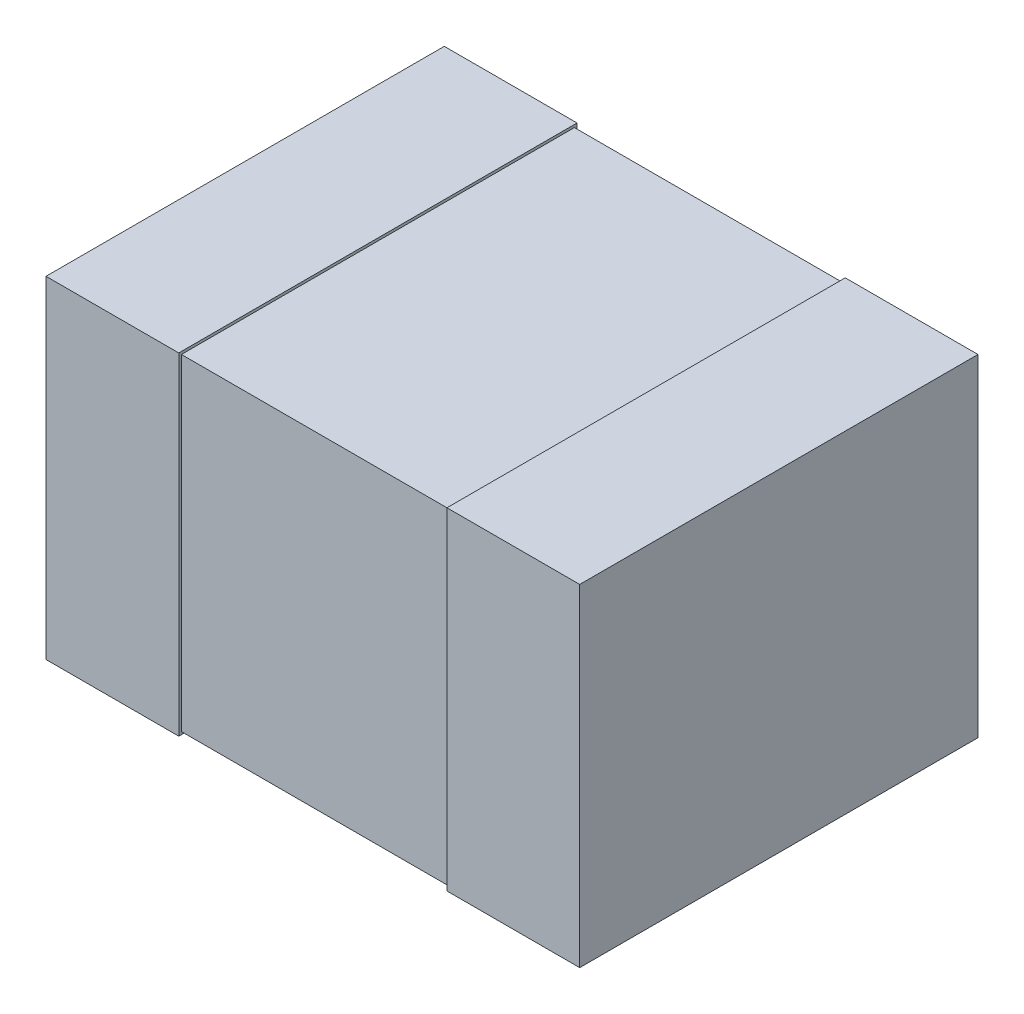
ISO-10303-21;
HEADER;
FILE_DESCRIPTION(('STEP AP214'),'2;1');
FILE_NAME('part.step','',(''),(''),'','','');
FILE_SCHEMA(('AUTOMOTIVE_DESIGN { 1 0 10303 214 1 1 1 1 }'));
ENDSEC;
DATA;
#1=APPLICATION_CONTEXT('core data for automotive mechanical design processes');
#2=APPLICATION_PROTOCOL_DEFINITION('international standard','automotive_design',2000,#1);
#3=PRODUCT_CONTEXT('',#1,'mechanical');
#4=PRODUCT('Part','Part','',(#3));
#5=PRODUCT_RELATED_PRODUCT_CATEGORY('part','',(#4));
#6=PRODUCT_DEFINITION_FORMATION('','',#4);
#7=PRODUCT_DEFINITION_CONTEXT('part definition',#1,'design');
#8=PRODUCT_DEFINITION('design','',#6,#7);
#9=PRODUCT_DEFINITION_SHAPE('','',#8);
#10=(LENGTH_UNIT() NAMED_UNIT(*) SI_UNIT(.MILLI.,.METRE.));
#11=(NAMED_UNIT(*) PLANE_ANGLE_UNIT() SI_UNIT($,.RADIAN.));
#12=(NAMED_UNIT(*) SI_UNIT($,.STERADIAN.) SOLID_ANGLE_UNIT());
#13=UNCERTAINTY_MEASURE_WITH_UNIT(LENGTH_MEASURE(1.E-05),#10,'distance_accuracy_value','');
#14=(GEOMETRIC_REPRESENTATION_CONTEXT(3) GLOBAL_UNCERTAINTY_ASSIGNED_CONTEXT((#13)) GLOBAL_UNIT_ASSIGNED_CONTEXT((#10,
#11,#12)) REPRESENTATION_CONTEXT('',''));
#15=CARTESIAN_POINT('',(0.,0.,0.));
#16=DIRECTION('',(0.,0.,1.));
#17=DIRECTION('',(1.,0.,0.));
#18=AXIS2_PLACEMENT_3D('',#15,#16,#17);
#19=CARTESIAN_POINT('',(1.005,-0.625,0.0762));
#20=DIRECTION('',(1.,0.,0.));
#21=DIRECTION('',(0.,1.,0.));
#22=AXIS2_PLACEMENT_3D('',#19,#20,#21);
#23=PLANE('',#22);
#24=DIRECTION('',(0.,0.,1.));
#25=VECTOR('',#24,1.);
#26=CARTESIAN_POINT('',(1.005,0.625,0.0762));
#27=LINE('',#26,#25);
#28=CARTESIAN_POINT('',(1.005,0.625,0.0762));
#29=VERTEX_POINT('',#28);
#30=CARTESIAN_POINT('',(1.005,0.625,1.5762));
#31=VERTEX_POINT('',#30);
#32=EDGE_CURVE('E241',#29,#31,#27,.T.);
#33=ORIENTED_EDGE('',*,*,#32,.T.);
#34=DIRECTION('',(0.,1.,0.));
#35=VECTOR('',#34,1.);
#36=CARTESIAN_POINT('',(1.005,-0.625,1.5762));
#37=LINE('',#36,#35);
#38=CARTESIAN_POINT('',(1.005,-0.625,1.5762));
#39=VERTEX_POINT('',#38);
#40=EDGE_CURVE('E196',#39,#31,#37,.T.);
#41=ORIENTED_EDGE('',*,*,#40,.F.);
#42=DIRECTION('',(0.,0.,1.));
#43=VECTOR('',#42,1.);
#44=CARTESIAN_POINT('',(1.005,-0.625,0.0762));
#45=LINE('',#44,#43);
#46=CARTESIAN_POINT('',(1.005,-0.625,0.0762));
#47=VERTEX_POINT('',#46);
#48=EDGE_CURVE('E11',#47,#39,#45,.T.);
#49=ORIENTED_EDGE('',*,*,#48,.F.);
#50=DIRECTION('',(0.,1.,0.));
#51=VECTOR('',#50,1.);
#52=CARTESIAN_POINT('',(1.005,-0.625,0.0762));
#53=LINE('',#52,#51);
#54=EDGE_CURVE('E221',#47,#29,#53,.T.);
#55=ORIENTED_EDGE('',*,*,#54,.T.);
#56=EDGE_LOOP('',(#33,#41,#49,#55));
#57=FACE_BOUND('',#56,.T.);
#58=ADVANCED_FACE('F17',(#57),#23,.T.);
#59=CARTESIAN_POINT('',(-1.005,0.625,0.0762));
#60=DIRECTION('',(-1.,0.,0.));
#61=DIRECTION('',(0.,0.,1.));
#62=AXIS2_PLACEMENT_3D('',#59,#60,#61);
#63=PLANE('',#62);
#64=DIRECTION('',(0.,0.,1.));
#65=VECTOR('',#64,1.);
#66=CARTESIAN_POINT('',(-1.005,-0.625,0.0762));
#67=LINE('',#66,#65);
#68=CARTESIAN_POINT('',(-1.005,-0.625,0.0762));
#69=VERTEX_POINT('',#68);
#70=CARTESIAN_POINT('',(-1.005,-0.625,1.5762));
#71=VERTEX_POINT('',#70);
#72=EDGE_CURVE('E27',#69,#71,#67,.T.);
#73=ORIENTED_EDGE('',*,*,#72,.T.);
#74=DIRECTION('',(0.,-1.,0.));
#75=VECTOR('',#74,1.);
#76=CARTESIAN_POINT('',(-1.005,0.625,1.5762));
#77=LINE('',#76,#75);
#78=CARTESIAN_POINT('',(-1.005,0.625,1.5762));
#79=VERTEX_POINT('',#78);
#80=EDGE_CURVE('E201',#79,#71,#77,.T.);
#81=ORIENTED_EDGE('',*,*,#80,.F.);
#82=DIRECTION('',(0.,0.,1.));
#83=VECTOR('',#82,1.);
#84=CARTESIAN_POINT('',(-1.005,0.625,0.0762));
#85=LINE('',#84,#83);
#86=CARTESIAN_POINT('',(-1.005,0.625,0.0762));
#87=VERTEX_POINT('',#86);
#88=EDGE_CURVE('E184',#87,#79,#85,.T.);
#89=ORIENTED_EDGE('',*,*,#88,.F.);
#90=DIRECTION('',(0.,-1.,0.));
#91=VECTOR('',#90,1.);
#92=CARTESIAN_POINT('',(-1.005,0.625,0.0762));
#93=LINE('',#92,#91);
#94=EDGE_CURVE('E208',#87,#69,#93,.T.);
#95=ORIENTED_EDGE('',*,*,#94,.T.);
#96=EDGE_LOOP('',(#73,#81,#89,#95));
#97=FACE_BOUND('',#96,.T.);
#98=ADVANCED_FACE('F316',(#97),#63,.T.);
#99=CARTESIAN_POINT('',(-1.005,-0.625,0.0762));
#100=DIRECTION('',(0.,-1.,0.));
#101=DIRECTION('',(0.,0.,-1.));
#102=AXIS2_PLACEMENT_3D('',#99,#100,#101);
#103=PLANE('',#102);
#104=DIRECTION('',(1.,0.,0.));
#105=VECTOR('',#104,1.);
#106=CARTESIAN_POINT('',(0.505,-0.625,0.0762));
#107=LINE('',#106,#105);
#108=CARTESIAN_POINT('',(0.505,-0.625,0.0762));
#109=VERTEX_POINT('',#108);
#110=EDGE_CURVE('E206',#109,#47,#107,.T.);
#111=ORIENTED_EDGE('',*,*,#110,.T.);
#112=ORIENTED_EDGE('',*,*,#48,.T.);
#113=DIRECTION('',(1.,0.,0.));
#114=VECTOR('',#113,1.);
#115=CARTESIAN_POINT('',(0.505,-0.625,1.5762));
#116=LINE('',#115,#114);
#117=CARTESIAN_POINT('',(0.505,-0.625,1.5762));
#118=VERTEX_POINT('',#117);
#119=EDGE_CURVE('E200',#118,#39,#116,.T.);
#120=ORIENTED_EDGE('',*,*,#119,.F.);
#121=DIRECTION('',(0.,0.,1.));
#122=VECTOR('',#121,1.);
#123=CARTESIAN_POINT('',(0.505,-0.625,0.0762));
#124=LINE('',#123,#122);
#125=EDGE_CURVE('E178',#109,#118,#124,.T.);
#126=ORIENTED_EDGE('',*,*,#125,.F.);
#127=EDGE_LOOP('',(#111,#112,#120,#126));
#128=FACE_BOUND('',#127,.T.);
#129=ADVANCED_FACE('F321',(#128),#103,.T.);
#130=CARTESIAN_POINT('',(-1.005,-0.625,0.0762));
#131=DIRECTION('',(0.,-1.,0.));
#132=DIRECTION('',(0.,0.,-1.));
#133=AXIS2_PLACEMENT_3D('',#130,#131,#132);
#134=PLANE('',#133);
#135=DIRECTION('',(1.,0.,0.));
#136=VECTOR('',#135,1.);
#137=CARTESIAN_POINT('',(-1.005,-0.625,1.5762));
#138=LINE('',#137,#136);
#139=CARTESIAN_POINT('',(-0.505,-0.625,1.5762));
#140=VERTEX_POINT('',#139);
#141=EDGE_CURVE('E197',#71,#140,#138,.T.);
#142=ORIENTED_EDGE('',*,*,#141,.F.);
#143=ORIENTED_EDGE('',*,*,#72,.F.);
#144=DIRECTION('',(1.,0.,0.));
#145=VECTOR('',#144,1.);
#146=CARTESIAN_POINT('',(-1.005,-0.625,0.0762));
#147=LINE('',#146,#145);
#148=CARTESIAN_POINT('',(-0.505,-0.625,0.0762));
#149=VERTEX_POINT('',#148);
#150=EDGE_CURVE('E211',#69,#149,#147,.T.);
#151=ORIENTED_EDGE('',*,*,#150,.T.);
#152=DIRECTION('',(0.,0.,1.));
#153=VECTOR('',#152,1.);
#154=CARTESIAN_POINT('',(-0.505,-0.625,0.0762));
#155=LINE('',#154,#153);
#156=EDGE_CURVE('E64',#149,#140,#155,.T.);
#157=ORIENTED_EDGE('',*,*,#156,.T.);
#158=EDGE_LOOP('',(#142,#143,#151,#157));
#159=FACE_BOUND('',#158,.T.);
#160=ADVANCED_FACE('F328',(#159),#134,.T.);
#161=CARTESIAN_POINT('',(0.,0.,1.5762));
#162=DIRECTION('',(0.,0.,1.));
#163=DIRECTION('',(1.,0.,0.));
#164=AXIS2_PLACEMENT_3D('',#161,#162,#163);
#165=PLANE('',#164);
#166=ORIENTED_EDGE('',*,*,#119,.T.);
#167=ORIENTED_EDGE('',*,*,#40,.T.);
#168=DIRECTION('',(-1.,0.,0.));
#169=VECTOR('',#168,1.);
#170=CARTESIAN_POINT('',(1.005,0.625,1.5762));
#171=LINE('',#170,#169);
#172=CARTESIAN_POINT('',(0.505,0.625,1.5762));
#173=VERTEX_POINT('',#172);
#174=EDGE_CURVE('E183',#31,#173,#171,.T.);
#175=ORIENTED_EDGE('',*,*,#174,.T.);
#176=DIRECTION('',(0.,1.,0.));
#177=VECTOR('',#176,1.);
#178=CARTESIAN_POINT('',(0.505,-0.625,1.5762));
#179=LINE('',#178,#177);
#180=EDGE_CURVE('E173',#118,#173,#179,.T.);
#181=ORIENTED_EDGE('',*,*,#180,.F.);
#182=EDGE_LOOP('',(#166,#167,#175,#181));
#183=FACE_BOUND('',#182,.T.);
#184=ADVANCED_FACE('F280',(#183),#165,.T.);
#185=CARTESIAN_POINT('',(0.,0.,1.5762));
#186=DIRECTION('',(0.,0.,1.));
#187=DIRECTION('',(1.,0.,0.));
#188=AXIS2_PLACEMENT_3D('',#185,#186,#187);
#189=PLANE('',#188);
#190=DIRECTION('',(-1.,0.,0.));
#191=VECTOR('',#190,1.);
#192=CARTESIAN_POINT('',(-0.505,0.625,1.5762));
#193=LINE('',#192,#191);
#194=CARTESIAN_POINT('',(-0.505,0.625,1.5762));
#195=VERTEX_POINT('',#194);
#196=EDGE_CURVE('E179',#195,#79,#193,.T.);
#197=ORIENTED_EDGE('',*,*,#196,.T.);
#198=ORIENTED_EDGE('',*,*,#80,.T.);
#199=ORIENTED_EDGE('',*,*,#141,.T.);
#200=DIRECTION('',(0.,1.,0.));
#201=VECTOR('',#200,1.);
#202=CARTESIAN_POINT('',(-0.505,-0.625,1.5762));
#203=LINE('',#202,#201);
#204=EDGE_CURVE('E238',#140,#195,#203,.T.);
#205=ORIENTED_EDGE('',*,*,#204,.T.);
#206=EDGE_LOOP('',(#197,#198,#199,#205));
#207=FACE_BOUND('',#206,.T.);
#208=ADVANCED_FACE('F344',(#207),#189,.T.);
#209=CARTESIAN_POINT('',(1.005,0.625,0.0762));
#210=DIRECTION('',(0.,1.,0.));
#211=DIRECTION('',(1.,0.,0.));
#212=AXIS2_PLACEMENT_3D('',#209,#210,#211);
#213=PLANE('',#212);
#214=ORIENTED_EDGE('',*,*,#174,.F.);
#215=ORIENTED_EDGE('',*,*,#32,.F.);
#216=DIRECTION('',(-1.,0.,0.));
#217=VECTOR('',#216,1.);
#218=CARTESIAN_POINT('',(1.005,0.625,0.0762));
#219=LINE('',#218,#217);
#220=CARTESIAN_POINT('',(0.505,0.625,0.0762));
#221=VERTEX_POINT('',#220);
#222=EDGE_CURVE('E214',#29,#221,#219,.T.);
#223=ORIENTED_EDGE('',*,*,#222,.T.);
#224=DIRECTION('',(0.,0.,1.));
#225=VECTOR('',#224,1.);
#226=CARTESIAN_POINT('',(0.505,0.625,0.0762));
#227=LINE('',#226,#225);
#228=EDGE_CURVE('E177',#221,#173,#227,.T.);
#229=ORIENTED_EDGE('',*,*,#228,.T.);
#230=EDGE_LOOP('',(#214,#215,#223,#229));
#231=FACE_BOUND('',#230,.T.);
#232=ADVANCED_FACE('F277',(#231),#213,.T.);
#233=CARTESIAN_POINT('',(1.005,0.625,0.0762));
#234=DIRECTION('',(0.,1.,0.));
#235=DIRECTION('',(1.,0.,0.));
#236=AXIS2_PLACEMENT_3D('',#233,#234,#235);
#237=PLANE('',#236);
#238=DIRECTION('',(-1.,0.,0.));
#239=VECTOR('',#238,1.);
#240=CARTESIAN_POINT('',(-0.505,0.625,0.0762));
#241=LINE('',#240,#239);
#242=CARTESIAN_POINT('',(-0.505,0.625,0.0762));
#243=VERTEX_POINT('',#242);
#244=EDGE_CURVE('E210',#243,#87,#241,.T.);
#245=ORIENTED_EDGE('',*,*,#244,.T.);
#246=ORIENTED_EDGE('',*,*,#88,.T.);
#247=ORIENTED_EDGE('',*,*,#196,.F.);
#248=DIRECTION('',(0.,0.,1.));
#249=VECTOR('',#248,1.);
#250=CARTESIAN_POINT('',(-0.505,0.625,0.0762));
#251=LINE('',#250,#249);
#252=EDGE_CURVE('E205',#243,#195,#251,.T.);
#253=ORIENTED_EDGE('',*,*,#252,.F.);
#254=EDGE_LOOP('',(#245,#246,#247,#253));
#255=FACE_BOUND('',#254,.T.);
#256=ADVANCED_FACE('F312',(#255),#237,.T.);
#257=CARTESIAN_POINT('',(0.505,-0.625,0.0862));
#258=DIRECTION('',(1.,0.,0.));
#259=DIRECTION('',(0.,1.,0.));
#260=AXIS2_PLACEMENT_3D('',#257,#258,#259);
#261=PLANE('',#260);
#262=DIRECTION('',(0.,0.,1.));
#263=VECTOR('',#262,1.);
#264=CARTESIAN_POINT('',(0.505,0.615,0.0862));
#265=LINE('',#264,#263);
#266=CARTESIAN_POINT('',(0.505,0.615,0.0862));
#267=VERTEX_POINT('',#266);
#268=CARTESIAN_POINT('',(0.505,0.615,1.5662));
#269=VERTEX_POINT('',#268);
#270=EDGE_CURVE('E147',#267,#269,#265,.T.);
#271=ORIENTED_EDGE('',*,*,#270,.T.);
#272=DIRECTION('',(0.,-1.,0.));
#273=VECTOR('',#272,1.);
#274=CARTESIAN_POINT('',(0.505,0.615,1.5662));
#275=LINE('',#274,#273);
#276=CARTESIAN_POINT('',(0.505,-0.615,1.5662));
#277=VERTEX_POINT('',#276);
#278=EDGE_CURVE('E139',#269,#277,#275,.T.);
#279=ORIENTED_EDGE('',*,*,#278,.T.);
#280=DIRECTION('',(0.,0.,-1.));
#281=VECTOR('',#280,1.);
#282=CARTESIAN_POINT('',(0.505,-0.615,1.5662));
#283=LINE('',#282,#281);
#284=CARTESIAN_POINT('',(0.505,-0.615,0.0862));
#285=VERTEX_POINT('',#284);
#286=EDGE_CURVE('E144',#277,#285,#283,.T.);
#287=ORIENTED_EDGE('',*,*,#286,.T.);
#288=DIRECTION('',(0.,1.,0.));
#289=VECTOR('',#288,1.);
#290=CARTESIAN_POINT('',(0.505,-0.615,0.0862));
#291=LINE('',#290,#289);
#292=EDGE_CURVE('E193',#285,#267,#291,.T.);
#293=ORIENTED_EDGE('',*,*,#292,.T.);
#294=EDGE_LOOP('',(#271,#279,#287,#293));
#295=FACE_BOUND('',#294,.T.);
#296=ORIENTED_EDGE('',*,*,#125,.T.);
#297=ORIENTED_EDGE('',*,*,#180,.T.);
#298=ORIENTED_EDGE('',*,*,#228,.F.);
#299=DIRECTION('',(0.,1.,0.));
#300=VECTOR('',#299,1.);
#301=CARTESIAN_POINT('',(0.505,-0.625,0.0762));
#302=LINE('',#301,#300);
#303=EDGE_CURVE('E202',#109,#221,#302,.T.);
#304=ORIENTED_EDGE('',*,*,#303,.F.);
#305=EDGE_LOOP('',(#296,#297,#298,#304));
#306=FACE_BOUND('',#305,.T.);
#307=ADVANCED_FACE('F141',(#295,#306),#261,.F.);
#308=CARTESIAN_POINT('',(-0.505,-0.625,0.0862));
#309=DIRECTION('',(0.,0.,1.));
#310=DIRECTION('',(1.,0.,0.));
#311=AXIS2_PLACEMENT_3D('',#308,#309,#310);
#312=PLANE('',#311);
#313=DIRECTION('',(0.,1.,0.));
#314=VECTOR('',#313,1.);
#315=CARTESIAN_POINT('',(-0.505,-0.615,0.0862));
#316=LINE('',#315,#314);
#317=CARTESIAN_POINT('',(-0.505,-0.615,0.0862));
#318=VERTEX_POINT('',#317);
#319=CARTESIAN_POINT('',(-0.505,0.615,0.0862));
#320=VERTEX_POINT('',#319);
#321=EDGE_CURVE('E185',#318,#320,#316,.T.);
#322=ORIENTED_EDGE('',*,*,#321,.T.);
#323=DIRECTION('',(1.,0.,0.));
#324=VECTOR('',#323,1.);
#325=CARTESIAN_POINT('',(-0.505,0.615,0.0862));
#326=LINE('',#325,#324);
#327=EDGE_CURVE('E20',#320,#267,#326,.T.);
#328=ORIENTED_EDGE('',*,*,#327,.T.);
#329=ORIENTED_EDGE('',*,*,#292,.F.);
#330=DIRECTION('',(1.,0.,0.));
#331=VECTOR('',#330,1.);
#332=CARTESIAN_POINT('',(-0.505,-0.615,0.0862));
#333=LINE('',#332,#331);
#334=EDGE_CURVE('E164',#318,#285,#333,.T.);
#335=ORIENTED_EDGE('',*,*,#334,.F.);
#336=EDGE_LOOP('',(#322,#328,#329,#335));
#337=FACE_BOUND('',#336,.T.);
#338=ADVANCED_FACE('F301',(#337),#312,.F.);
#339=CARTESIAN_POINT('',(-0.505,0.615,0.0762));
#340=DIRECTION('',(0.,-1.,0.));
#341=DIRECTION('',(0.,0.,-1.));
#342=AXIS2_PLACEMENT_3D('',#339,#340,#341);
#343=PLANE('',#342);
#344=DIRECTION('',(0.,0.,1.));
#345=VECTOR('',#344,1.);
#346=CARTESIAN_POINT('',(-0.505,0.615,0.0862));
#347=LINE('',#346,#345);
#348=CARTESIAN_POINT('',(-0.505,0.615,1.5662));
#349=VERTEX_POINT('',#348);
#350=EDGE_CURVE('E189',#320,#349,#347,.T.);
#351=ORIENTED_EDGE('',*,*,#350,.T.);
#352=DIRECTION('',(1.,0.,0.));
#353=VECTOR('',#352,1.);
#354=CARTESIAN_POINT('',(-0.505,0.615,1.5662));
#355=LINE('',#354,#353);
#356=EDGE_CURVE('E151',#349,#269,#355,.T.);
#357=ORIENTED_EDGE('',*,*,#356,.T.);
#358=ORIENTED_EDGE('',*,*,#270,.F.);
#359=ORIENTED_EDGE('',*,*,#327,.F.);
#360=EDGE_LOOP('',(#351,#357,#358,#359));
#361=FACE_BOUND('',#360,.T.);
#362=ADVANCED_FACE('F294',(#361),#343,.F.);
#363=CARTESIAN_POINT('',(-0.505,0.625,1.5662));
#364=DIRECTION('',(0.,0.,-1.));
#365=DIRECTION('',(0.,-1.,0.));
#366=AXIS2_PLACEMENT_3D('',#363,#364,#365);
#367=PLANE('',#366);
#368=DIRECTION('',(0.,-1.,0.));
#369=VECTOR('',#368,1.);
#370=CARTESIAN_POINT('',(-0.505,0.615,1.5662));
#371=LINE('',#370,#369);
#372=CARTESIAN_POINT('',(-0.505,-0.615,1.5662));
#373=VERTEX_POINT('',#372);
#374=EDGE_CURVE('E157',#349,#373,#371,.T.);
#375=ORIENTED_EDGE('',*,*,#374,.T.);
#376=DIRECTION('',(1.,0.,0.));
#377=VECTOR('',#376,1.);
#378=CARTESIAN_POINT('',(-0.505,-0.615,1.5662));
#379=LINE('',#378,#377);
#380=EDGE_CURVE('E152',#373,#277,#379,.T.);
#381=ORIENTED_EDGE('',*,*,#380,.T.);
#382=ORIENTED_EDGE('',*,*,#278,.F.);
#383=ORIENTED_EDGE('',*,*,#356,.F.);
#384=EDGE_LOOP('',(#375,#381,#382,#383));
#385=FACE_BOUND('',#384,.T.);
#386=ADVANCED_FACE('F155',(#385),#367,.F.);
#387=CARTESIAN_POINT('',(-0.505,-0.615,1.5762));
#388=DIRECTION('',(0.,1.,0.));
#389=DIRECTION('',(1.,0.,0.));
#390=AXIS2_PLACEMENT_3D('',#387,#388,#389);
#391=PLANE('',#390);
#392=DIRECTION('',(0.,0.,-1.));
#393=VECTOR('',#392,1.);
#394=CARTESIAN_POINT('',(-0.505,-0.615,1.5662));
#395=LINE('',#394,#393);
#396=EDGE_CURVE('E169',#373,#318,#395,.T.);
#397=ORIENTED_EDGE('',*,*,#396,.T.);
#398=ORIENTED_EDGE('',*,*,#334,.T.);
#399=ORIENTED_EDGE('',*,*,#286,.F.);
#400=ORIENTED_EDGE('',*,*,#380,.F.);
#401=EDGE_LOOP('',(#397,#398,#399,#400));
#402=FACE_BOUND('',#401,.T.);
#403=ADVANCED_FACE('F163',(#402),#391,.F.);
#404=CARTESIAN_POINT('',(-0.505,-0.625,0.0762));
#405=DIRECTION('',(-1.,0.,0.));
#406=DIRECTION('',(0.,0.,1.));
#407=AXIS2_PLACEMENT_3D('',#404,#405,#406);
#408=PLANE('',#407);
#409=ORIENTED_EDGE('',*,*,#374,.F.);
#410=ORIENTED_EDGE('',*,*,#350,.F.);
#411=ORIENTED_EDGE('',*,*,#321,.F.);
#412=ORIENTED_EDGE('',*,*,#396,.F.);
#413=EDGE_LOOP('',(#409,#410,#411,#412));
#414=FACE_BOUND('',#413,.T.);
#415=ORIENTED_EDGE('',*,*,#252,.T.);
#416=ORIENTED_EDGE('',*,*,#204,.F.);
#417=ORIENTED_EDGE('',*,*,#156,.F.);
#418=DIRECTION('',(0.,1.,0.));
#419=VECTOR('',#418,1.);
#420=CARTESIAN_POINT('',(-0.505,-0.625,0.0762));
#421=LINE('',#420,#419);
#422=EDGE_CURVE('E212',#149,#243,#421,.T.);
#423=ORIENTED_EDGE('',*,*,#422,.T.);
#424=EDGE_LOOP('',(#415,#416,#417,#423));
#425=FACE_BOUND('',#424,.T.);
#426=ADVANCED_FACE('F299',(#414,#425),#408,.F.);
#427=CARTESIAN_POINT('',(0.,0.,0.0762));
#428=DIRECTION('',(0.,0.,1.));
#429=DIRECTION('',(1.,0.,0.));
#430=AXIS2_PLACEMENT_3D('',#427,#428,#429);
#431=PLANE('',#430);
#432=ORIENTED_EDGE('',*,*,#222,.F.);
#433=ORIENTED_EDGE('',*,*,#54,.F.);
#434=ORIENTED_EDGE('',*,*,#110,.F.);
#435=ORIENTED_EDGE('',*,*,#303,.T.);
#436=EDGE_LOOP('',(#432,#433,#434,#435));
#437=FACE_BOUND('',#436,.T.);
#438=ADVANCED_FACE('F334',(#437),#431,.F.);
#439=CARTESIAN_POINT('',(0.,0.,0.0762));
#440=DIRECTION('',(0.,0.,1.));
#441=DIRECTION('',(1.,0.,0.));
#442=AXIS2_PLACEMENT_3D('',#439,#440,#441);
#443=PLANE('',#442);
#444=ORIENTED_EDGE('',*,*,#150,.F.);
#445=ORIENTED_EDGE('',*,*,#94,.F.);
#446=ORIENTED_EDGE('',*,*,#244,.F.);
#447=ORIENTED_EDGE('',*,*,#422,.F.);
#448=EDGE_LOOP('',(#444,#445,#446,#447));
#449=FACE_BOUND('',#448,.T.);
#450=ADVANCED_FACE('F332',(#449),#443,.F.);
#451=CLOSED_SHELL('',(#58,#98,#129,#160,#184,#208,#232,#256,#307,#338,#362,#386,#403,#426,#438,#450));
#452=MANIFOLD_SOLID_BREP('B1',#451);
#453=ADVANCED_BREP_SHAPE_REPRESENTATION('',(#18,#452),#14);
#454=SHAPE_DEFINITION_REPRESENTATION(#9,#453);
ENDSEC;
END-ISO-10303-21;
